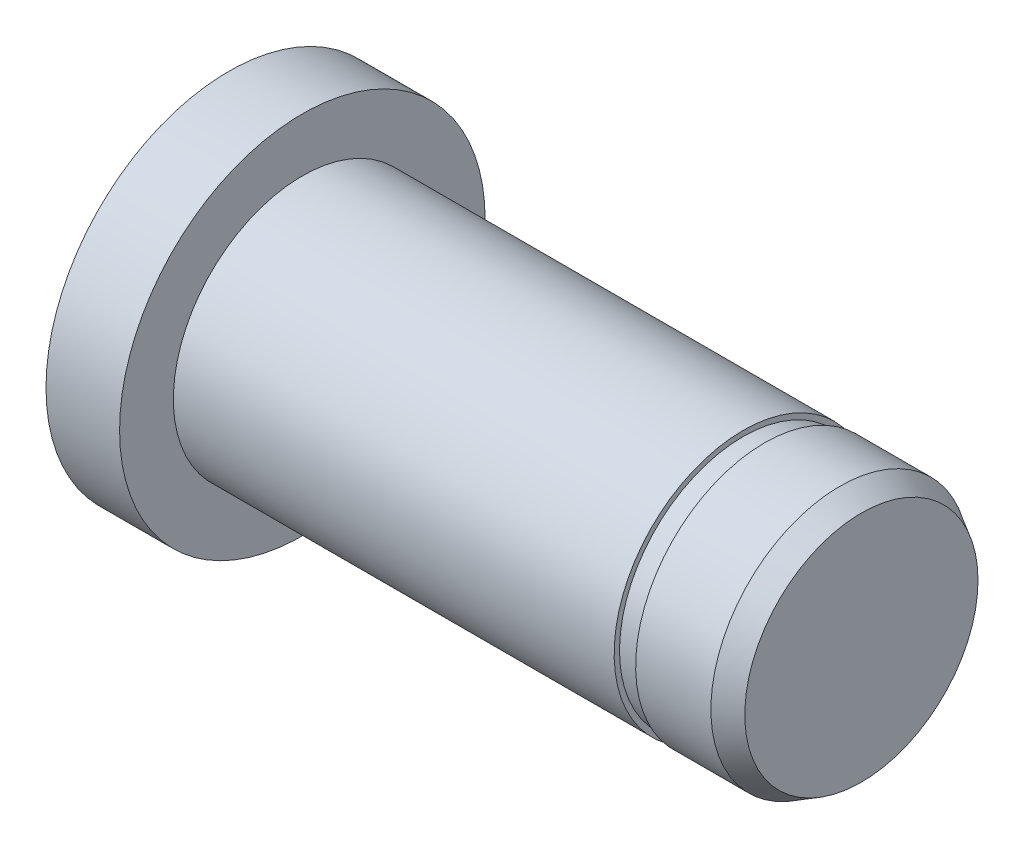
ISO-10303-21;
HEADER;
FILE_DESCRIPTION(('STEP AP214'),'2;1');
FILE_NAME('part.step','',(''),(''),'','','');
FILE_SCHEMA(('AUTOMOTIVE_DESIGN { 1 0 10303 214 1 1 1 1 }'));
ENDSEC;
DATA;
#1=APPLICATION_CONTEXT('core data for automotive mechanical design processes');
#2=APPLICATION_PROTOCOL_DEFINITION('international standard','automotive_design',2000,#1);
#3=PRODUCT_CONTEXT('',#1,'mechanical');
#4=PRODUCT('Part','Part','',(#3));
#5=PRODUCT_RELATED_PRODUCT_CATEGORY('part','',(#4));
#6=PRODUCT_DEFINITION_FORMATION('','',#4);
#7=PRODUCT_DEFINITION_CONTEXT('part definition',#1,'design');
#8=PRODUCT_DEFINITION('design','',#6,#7);
#9=PRODUCT_DEFINITION_SHAPE('','',#8);
#10=(LENGTH_UNIT() NAMED_UNIT(*) SI_UNIT(.MILLI.,.METRE.));
#11=(NAMED_UNIT(*) PLANE_ANGLE_UNIT() SI_UNIT($,.RADIAN.));
#12=(NAMED_UNIT(*) SI_UNIT($,.STERADIAN.) SOLID_ANGLE_UNIT());
#13=UNCERTAINTY_MEASURE_WITH_UNIT(LENGTH_MEASURE(1.E-05),#10,'distance_accuracy_value','');
#14=(GEOMETRIC_REPRESENTATION_CONTEXT(3) GLOBAL_UNCERTAINTY_ASSIGNED_CONTEXT((#13)) GLOBAL_UNIT_ASSIGNED_CONTEXT((#10,
#11,#12)) REPRESENTATION_CONTEXT('',''));
#15=CARTESIAN_POINT('',(0.,0.,0.));
#16=DIRECTION('',(0.,0.,1.));
#17=DIRECTION('',(1.,0.,0.));
#18=AXIS2_PLACEMENT_3D('',#15,#16,#17);
#19=CARTESIAN_POINT('',(30.,0.,0.));
#20=DIRECTION('',(1.,0.,0.));
#21=DIRECTION('',(0.,0.,-1.));
#22=AXIS2_PLACEMENT_3D('',#19,#20,#21);
#23=CYLINDRICAL_SURFACE('',#22,6.);
#24=CARTESIAN_POINT('',(4.,0.,0.));
#25=DIRECTION('',(1.,0.,0.));
#26=DIRECTION('',(0.,0.,-1.));
#27=AXIS2_PLACEMENT_3D('',#24,#25,#26);
#28=CIRCLE('',#27,6.);
#29=CARTESIAN_POINT('',(4.,0.,-6.));
#30=VERTEX_POINT('',#29);
#31=EDGE_CURVE('E68',#30,#30,#28,.T.);
#32=ORIENTED_EDGE('',*,*,#31,.T.);
#33=EDGE_LOOP('',(#32));
#34=FACE_BOUND('',#33,.T.);
#35=CARTESIAN_POINT('',(24.5,0.,0.));
#36=DIRECTION('',(1.,0.,0.));
#37=DIRECTION('',(0.,1.,0.));
#38=AXIS2_PLACEMENT_3D('',#35,#36,#37);
#39=CIRCLE('',#38,6.);
#40=CARTESIAN_POINT('',(24.5,6.,0.));
#41=VERTEX_POINT('',#40);
#42=EDGE_CURVE('E72',#41,#41,#39,.T.);
#43=ORIENTED_EDGE('',*,*,#42,.F.);
#44=EDGE_LOOP('',(#43));
#45=FACE_BOUND('',#44,.T.);
#46=ADVANCED_FACE('F39',(#34,#45),#23,.T.);
#47=CARTESIAN_POINT('',(0.,0.,0.));
#48=DIRECTION('',(-1.,0.,0.));
#49=DIRECTION('',(0.,0.,1.));
#50=AXIS2_PLACEMENT_3D('',#47,#48,#49);
#51=PLANE('',#50);
#52=CARTESIAN_POINT('',(0.,0.,0.));
#53=DIRECTION('',(-1.,0.,0.));
#54=DIRECTION('',(0.,0.,1.));
#55=AXIS2_PLACEMENT_3D('',#52,#53,#54);
#56=CIRCLE('',#55,7.5);
#57=CARTESIAN_POINT('',(0.,0.,7.5));
#58=VERTEX_POINT('',#57);
#59=EDGE_CURVE('E10',#58,#58,#56,.T.);
#60=ORIENTED_EDGE('',*,*,#59,.T.);
#61=EDGE_LOOP('',(#60));
#62=FACE_BOUND('',#61,.T.);
#63=ADVANCED_FACE('F100',(#62),#51,.T.);
#64=CARTESIAN_POINT('',(30.,0.,0.));
#65=DIRECTION('',(1.,0.,0.));
#66=DIRECTION('',(0.,0.,-1.));
#67=AXIS2_PLACEMENT_3D('',#64,#65,#66);
#68=CYLINDRICAL_SURFACE('',#67,8.5);
#69=CARTESIAN_POINT('',(0.577350269189623,0.,0.));
#70=DIRECTION('',(-1.,0.,0.));
#71=DIRECTION('',(0.,0.,1.));
#72=AXIS2_PLACEMENT_3D('',#69,#70,#71);
#73=CIRCLE('',#72,8.5);
#74=CARTESIAN_POINT('',(0.577350269189623,0.,8.5));
#75=VERTEX_POINT('',#74);
#76=EDGE_CURVE('E48',#75,#75,#73,.F.);
#77=ORIENTED_EDGE('',*,*,#76,.T.);
#78=EDGE_LOOP('',(#77));
#79=FACE_BOUND('',#78,.T.);
#80=CARTESIAN_POINT('',(4.,0.,0.));
#81=DIRECTION('',(1.,0.,0.));
#82=DIRECTION('',(0.,0.,-1.));
#83=AXIS2_PLACEMENT_3D('',#80,#81,#82);
#84=CIRCLE('',#83,8.5);
#85=CARTESIAN_POINT('',(4.,0.,-8.5));
#86=VERTEX_POINT('',#85);
#87=EDGE_CURVE('E64',#86,#86,#84,.T.);
#88=ORIENTED_EDGE('',*,*,#87,.F.);
#89=EDGE_LOOP('',(#88));
#90=FACE_BOUND('',#89,.T.);
#91=ADVANCED_FACE('F107',(#79,#90),#68,.T.);
#92=CARTESIAN_POINT('',(4.,8.5,0.));
#93=DIRECTION('',(1.,0.,0.));
#94=DIRECTION('',(0.,0.,-1.));
#95=AXIS2_PLACEMENT_3D('',#92,#93,#94);
#96=PLANE('',#95);
#97=ORIENTED_EDGE('',*,*,#87,.T.);
#98=EDGE_LOOP('',(#97));
#99=FACE_BOUND('',#98,.T.);
#100=ORIENTED_EDGE('',*,*,#31,.F.);
#101=EDGE_LOOP('',(#100));
#102=FACE_BOUND('',#101,.T.);
#103=ADVANCED_FACE('F154',(#99,#102),#96,.T.);
#104=CARTESIAN_POINT('',(0.577350269189623,0.,0.));
#105=DIRECTION('',(1.,0.,0.));
#106=DIRECTION('',(0.,0.,-1.));
#107=AXIS2_PLACEMENT_3D('',#104,#105,#106);
#108=CONICAL_SURFACE('',#107,8.5,1.0471975511966);
#109=ORIENTED_EDGE('',*,*,#59,.F.);
#110=EDGE_LOOP('',(#109));
#111=FACE_BOUND('',#110,.T.);
#112=ORIENTED_EDGE('',*,*,#76,.F.);
#113=EDGE_LOOP('',(#112));
#114=FACE_BOUND('',#113,.T.);
#115=ADVANCED_FACE('F42',(#111,#114),#108,.T.);
#116=CARTESIAN_POINT('',(24.5,0.,0.));
#117=DIRECTION('',(1.,0.,0.));
#118=DIRECTION('',(0.,1.,0.));
#119=AXIS2_PLACEMENT_3D('',#116,#117,#118);
#120=PLANE('',#119);
#121=CARTESIAN_POINT('',(24.5,0.,0.));
#122=DIRECTION('',(1.,0.,0.));
#123=DIRECTION('',(0.,1.,0.));
#124=AXIS2_PLACEMENT_3D('',#121,#122,#123);
#125=CIRCLE('',#124,5.75);
#126=CARTESIAN_POINT('',(24.5,5.75,0.));
#127=VERTEX_POINT('',#126);
#128=EDGE_CURVE('E77',#127,#127,#125,.T.);
#129=ORIENTED_EDGE('',*,*,#128,.F.);
#130=EDGE_LOOP('',(#129));
#131=FACE_BOUND('',#130,.T.);
#132=ORIENTED_EDGE('',*,*,#42,.T.);
#133=EDGE_LOOP('',(#132));
#134=FACE_BOUND('',#133,.T.);
#135=ADVANCED_FACE('F92',(#131,#134),#120,.T.);
#136=CARTESIAN_POINT('',(25.5,0.,0.));
#137=DIRECTION('',(1.,0.,0.));
#138=DIRECTION('',(0.,1.,0.));
#139=AXIS2_PLACEMENT_3D('',#136,#137,#138);
#140=PLANE('',#139);
#141=CARTESIAN_POINT('',(25.5,0.,0.));
#142=DIRECTION('',(1.,0.,0.));
#143=DIRECTION('',(0.,1.,0.));
#144=AXIS2_PLACEMENT_3D('',#141,#142,#143);
#145=CIRCLE('',#144,5.75);
#146=CARTESIAN_POINT('',(25.5,5.75,0.));
#147=VERTEX_POINT('',#146);
#148=EDGE_CURVE('E81',#147,#147,#145,.T.);
#149=ORIENTED_EDGE('',*,*,#148,.T.);
#150=EDGE_LOOP('',(#149));
#151=FACE_BOUND('',#150,.T.);
#152=CARTESIAN_POINT('',(25.5,0.,0.));
#153=DIRECTION('',(1.,0.,0.));
#154=DIRECTION('',(0.,1.,0.));
#155=AXIS2_PLACEMENT_3D('',#152,#153,#154);
#156=CIRCLE('',#155,6.);
#157=CARTESIAN_POINT('',(25.5,6.,0.));
#158=VERTEX_POINT('',#157);
#159=EDGE_CURVE('E73',#158,#158,#156,.T.);
#160=ORIENTED_EDGE('',*,*,#159,.F.);
#161=EDGE_LOOP('',(#160));
#162=FACE_BOUND('',#161,.T.);
#163=ADVANCED_FACE('F95',(#151,#162),#140,.F.);
#164=CARTESIAN_POINT('',(24.5,0.,0.));
#165=DIRECTION('',(1.,0.,0.));
#166=DIRECTION('',(0.,1.,0.));
#167=AXIS2_PLACEMENT_3D('',#164,#165,#166);
#168=CYLINDRICAL_SURFACE('',#167,5.75);
#169=ORIENTED_EDGE('',*,*,#128,.T.);
#170=EDGE_LOOP('',(#169));
#171=FACE_BOUND('',#170,.T.);
#172=ORIENTED_EDGE('',*,*,#148,.F.);
#173=EDGE_LOOP('',(#172));
#174=FACE_BOUND('',#173,.T.);
#175=ADVANCED_FACE('F89',(#171,#174),#168,.T.);
#176=CARTESIAN_POINT('',(30.,6.,0.));
#177=DIRECTION('',(1.,0.,0.));
#178=DIRECTION('',(0.,0.,-1.));
#179=AXIS2_PLACEMENT_3D('',#176,#177,#178);
#180=PLANE('',#179);
#181=CARTESIAN_POINT('',(30.,0.,0.));
#182=DIRECTION('',(1.,0.,0.));
#183=DIRECTION('',(0.,0.,-1.));
#184=AXIS2_PLACEMENT_3D('',#181,#182,#183);
#185=CIRCLE('',#184,5.42264973081038);
#186=CARTESIAN_POINT('',(30.,0.,-5.42264973081038));
#187=VERTEX_POINT('',#186);
#188=EDGE_CURVE('E58',#187,#187,#185,.T.);
#189=ORIENTED_EDGE('',*,*,#188,.T.);
#190=EDGE_LOOP('',(#189));
#191=FACE_BOUND('',#190,.T.);
#192=ADVANCED_FACE('F117',(#191),#180,.T.);
#193=CARTESIAN_POINT('',(30.,0.,0.));
#194=DIRECTION('',(-1.,0.,0.));
#195=DIRECTION('',(0.,0.,1.));
#196=AXIS2_PLACEMENT_3D('',#193,#194,#195);
#197=CONICAL_SURFACE('',#196,5.42264973081038,0.523598775598294);
#198=CARTESIAN_POINT('',(29.,0.,0.));
#199=DIRECTION('',(1.,0.,0.));
#200=DIRECTION('',(0.,0.,-1.));
#201=AXIS2_PLACEMENT_3D('',#198,#199,#200);
#202=CIRCLE('',#201,6.);
#203=CARTESIAN_POINT('',(29.,0.,-6.));
#204=VERTEX_POINT('',#203);
#205=EDGE_CURVE('E53',#204,#204,#202,.F.);
#206=ORIENTED_EDGE('',*,*,#205,.F.);
#207=EDGE_LOOP('',(#206));
#208=FACE_BOUND('',#207,.T.);
#209=ORIENTED_EDGE('',*,*,#188,.F.);
#210=EDGE_LOOP('',(#209));
#211=FACE_BOUND('',#210,.T.);
#212=ADVANCED_FACE('F112',(#208,#211),#197,.T.);
#213=ORIENTED_EDGE('',*,*,#159,.T.);
#214=EDGE_LOOP('',(#213));
#215=FACE_BOUND('',#214,.T.);
#216=ORIENTED_EDGE('',*,*,#205,.T.);
#217=EDGE_LOOP('',(#216));
#218=FACE_BOUND('',#217,.T.);
#219=ADVANCED_FACE('F103',(#215,#218),#23,.T.);
#220=CLOSED_SHELL('',(#46,#63,#91,#103,#115,#135,#163,#175,#192,#212,#219));
#221=MANIFOLD_SOLID_BREP('B2',#220);
#222=ADVANCED_BREP_SHAPE_REPRESENTATION('',(#18,#221),#14);
#223=SHAPE_DEFINITION_REPRESENTATION(#9,#222);
ENDSEC;
END-ISO-10303-21;
